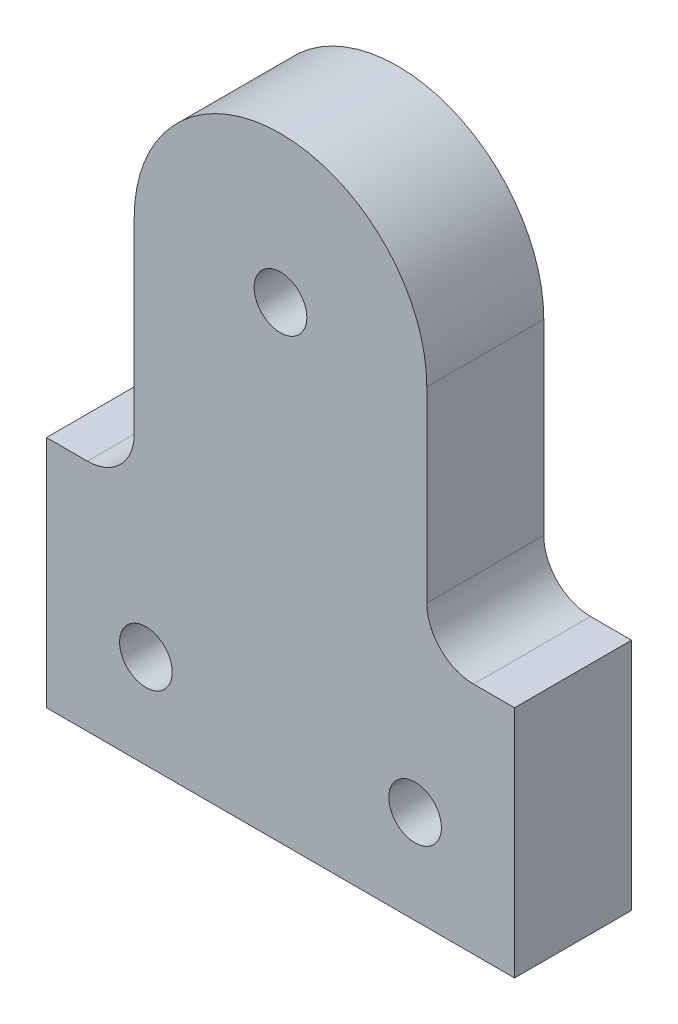
ISO-10303-21;
HEADER;
FILE_DESCRIPTION(('STEP AP214'),'2;1');
FILE_NAME('part.step','',(''),(''),'','','');
FILE_SCHEMA(('AUTOMOTIVE_DESIGN { 1 0 10303 214 1 1 1 1 }'));
ENDSEC;
DATA;
#1=APPLICATION_CONTEXT('core data for automotive mechanical design processes');
#2=APPLICATION_PROTOCOL_DEFINITION('international standard','automotive_design',2000,#1);
#3=PRODUCT_CONTEXT('',#1,'mechanical');
#4=PRODUCT('Part','Part','',(#3));
#5=PRODUCT_RELATED_PRODUCT_CATEGORY('part','',(#4));
#6=PRODUCT_DEFINITION_FORMATION('','',#4);
#7=PRODUCT_DEFINITION_CONTEXT('part definition',#1,'design');
#8=PRODUCT_DEFINITION('design','',#6,#7);
#9=PRODUCT_DEFINITION_SHAPE('','',#8);
#10=(LENGTH_UNIT() NAMED_UNIT(*) SI_UNIT(.MILLI.,.METRE.));
#11=(NAMED_UNIT(*) PLANE_ANGLE_UNIT() SI_UNIT($,.RADIAN.));
#12=(NAMED_UNIT(*) SI_UNIT($,.STERADIAN.) SOLID_ANGLE_UNIT());
#13=UNCERTAINTY_MEASURE_WITH_UNIT(LENGTH_MEASURE(1.E-05),#10,'distance_accuracy_value','');
#14=(GEOMETRIC_REPRESENTATION_CONTEXT(3) GLOBAL_UNCERTAINTY_ASSIGNED_CONTEXT((#13)) GLOBAL_UNIT_ASSIGNED_CONTEXT((#10,
#11,#12)) REPRESENTATION_CONTEXT('',''));
#15=CARTESIAN_POINT('',(0.,0.,0.));
#16=DIRECTION('',(0.,0.,1.));
#17=DIRECTION('',(1.,0.,0.));
#18=AXIS2_PLACEMENT_3D('',#15,#16,#17);
#19=CARTESIAN_POINT('',(-11.5,0.,10.));
#20=DIRECTION('',(0.,0.,-1.));
#21=DIRECTION('',(-1.,0.,0.));
#22=AXIS2_PLACEMENT_3D('',#19,#20,#21);
#23=CYLINDRICAL_SURFACE('',#22,2.25);
#24=CARTESIAN_POINT('',(-11.5,0.,10.));
#25=DIRECTION('',(0.,0.,1.));
#26=DIRECTION('',(1.,0.,0.));
#27=AXIS2_PLACEMENT_3D('',#24,#25,#26);
#28=CIRCLE('',#27,2.25);
#29=CARTESIAN_POINT('',(-9.25,0.,10.));
#30=VERTEX_POINT('',#29);
#31=EDGE_CURVE('E295',#30,#30,#28,.T.);
#32=ORIENTED_EDGE('',*,*,#31,.T.);
#33=EDGE_LOOP('',(#32));
#34=FACE_BOUND('',#33,.T.);
#35=CARTESIAN_POINT('',(-11.5,0.,3.));
#36=DIRECTION('',(0.,0.,-1.));
#37=DIRECTION('',(-1.,0.,0.));
#38=AXIS2_PLACEMENT_3D('',#35,#36,#37);
#39=CIRCLE('',#38,2.25);
#40=CARTESIAN_POINT('',(-13.75,0.,3.));
#41=VERTEX_POINT('',#40);
#42=EDGE_CURVE('E38',#41,#41,#39,.T.);
#43=ORIENTED_EDGE('',*,*,#42,.T.);
#44=EDGE_LOOP('',(#43));
#45=FACE_BOUND('',#44,.T.);
#46=ADVANCED_FACE('F34',(#34,#45),#23,.F.);
#47=CARTESIAN_POINT('',(11.5,0.,10.));
#48=DIRECTION('',(0.,0.,-1.));
#49=DIRECTION('',(-1.,0.,0.));
#50=AXIS2_PLACEMENT_3D('',#47,#48,#49);
#51=CYLINDRICAL_SURFACE('',#50,2.25);
#52=CARTESIAN_POINT('',(11.5,0.,10.));
#53=DIRECTION('',(0.,0.,1.));
#54=DIRECTION('',(-1.,0.,0.));
#55=AXIS2_PLACEMENT_3D('',#52,#53,#54);
#56=CIRCLE('',#55,2.25);
#57=CARTESIAN_POINT('',(9.25,0.,10.));
#58=VERTEX_POINT('',#57);
#59=EDGE_CURVE('E289',#58,#58,#56,.T.);
#60=ORIENTED_EDGE('',*,*,#59,.T.);
#61=EDGE_LOOP('',(#60));
#62=FACE_BOUND('',#61,.T.);
#63=CARTESIAN_POINT('',(11.5,0.,3.));
#64=DIRECTION('',(0.,0.,-1.));
#65=DIRECTION('',(-1.,0.,0.));
#66=AXIS2_PLACEMENT_3D('',#63,#64,#65);
#67=CIRCLE('',#66,2.25);
#68=CARTESIAN_POINT('',(9.25,0.,3.));
#69=VERTEX_POINT('',#68);
#70=EDGE_CURVE('E233',#69,#69,#67,.T.);
#71=ORIENTED_EDGE('',*,*,#70,.T.);
#72=EDGE_LOOP('',(#71));
#73=FACE_BOUND('',#72,.T.);
#74=ADVANCED_FACE('F427',(#62,#73),#51,.F.);
#75=CARTESIAN_POINT('',(0.,32.,10.));
#76=DIRECTION('',(0.,0.,1.));
#77=DIRECTION('',(1.,0.,0.));
#78=AXIS2_PLACEMENT_3D('',#75,#76,#77);
#79=PLANE('',#78);
#80=ORIENTED_EDGE('',*,*,#59,.F.);
#81=EDGE_LOOP('',(#80));
#82=FACE_BOUND('',#81,.T.);
#83=CARTESIAN_POINT('',(0.,32.,10.));
#84=DIRECTION('',(0.,0.,1.));
#85=DIRECTION('',(1.,0.,0.));
#86=AXIS2_PLACEMENT_3D('',#83,#84,#85);
#87=CIRCLE('',#86,12.5);
#88=CARTESIAN_POINT('',(12.5,32.,10.));
#89=VERTEX_POINT('',#88);
#90=CARTESIAN_POINT('',(-12.5,32.,10.));
#91=VERTEX_POINT('',#90);
#92=EDGE_CURVE('E299',#89,#91,#87,.T.);
#93=ORIENTED_EDGE('',*,*,#92,.T.);
#94=DIRECTION('',(0.,-1.,0.));
#95=VECTOR('',#94,1.);
#96=CARTESIAN_POINT('',(-12.5,32.,10.));
#97=LINE('',#96,#95);
#98=CARTESIAN_POINT('',(-12.5,16.,10.));
#99=VERTEX_POINT('',#98);
#100=EDGE_CURVE('E302',#91,#99,#97,.T.);
#101=ORIENTED_EDGE('',*,*,#100,.T.);
#102=CARTESIAN_POINT('',(-16.5,16.,10.));
#103=DIRECTION('',(0.,0.,-1.));
#104=DIRECTION('',(1.,0.,0.));
#105=AXIS2_PLACEMENT_3D('',#102,#103,#104);
#106=CIRCLE('',#105,4.);
#107=CARTESIAN_POINT('',(-16.5,12.,10.));
#108=VERTEX_POINT('',#107);
#109=EDGE_CURVE('E305',#99,#108,#106,.T.);
#110=ORIENTED_EDGE('',*,*,#109,.T.);
#111=DIRECTION('',(-1.,0.,0.));
#112=VECTOR('',#111,1.);
#113=CARTESIAN_POINT('',(-16.5,12.,10.));
#114=LINE('',#113,#112);
#115=CARTESIAN_POINT('',(-20.,12.,10.));
#116=VERTEX_POINT('',#115);
#117=EDGE_CURVE('E307',#108,#116,#114,.T.);
#118=ORIENTED_EDGE('',*,*,#117,.T.);
#119=DIRECTION('',(0.,-1.,0.));
#120=VECTOR('',#119,1.);
#121=CARTESIAN_POINT('',(-20.,12.,10.));
#122=LINE('',#121,#120);
#123=CARTESIAN_POINT('',(-20.,-8.,10.));
#124=VERTEX_POINT('',#123);
#125=EDGE_CURVE('E309',#116,#124,#122,.T.);
#126=ORIENTED_EDGE('',*,*,#125,.T.);
#127=DIRECTION('',(1.,0.,0.));
#128=VECTOR('',#127,1.);
#129=CARTESIAN_POINT('',(-20.,-8.,10.));
#130=LINE('',#129,#128);
#131=CARTESIAN_POINT('',(20.,-7.99999999999999,10.));
#132=VERTEX_POINT('',#131);
#133=EDGE_CURVE('E311',#124,#132,#130,.T.);
#134=ORIENTED_EDGE('',*,*,#133,.T.);
#135=DIRECTION('',(0.,1.,0.));
#136=VECTOR('',#135,1.);
#137=CARTESIAN_POINT('',(20.,12.,10.));
#138=LINE('',#137,#136);
#139=CARTESIAN_POINT('',(20.,12.,10.));
#140=VERTEX_POINT('',#139);
#141=EDGE_CURVE('E313',#132,#140,#138,.T.);
#142=ORIENTED_EDGE('',*,*,#141,.T.);
#143=DIRECTION('',(-1.,0.,0.));
#144=VECTOR('',#143,1.);
#145=CARTESIAN_POINT('',(16.5,12.,10.));
#146=LINE('',#145,#144);
#147=CARTESIAN_POINT('',(16.5,12.,10.));
#148=VERTEX_POINT('',#147);
#149=EDGE_CURVE('E315',#140,#148,#146,.T.);
#150=ORIENTED_EDGE('',*,*,#149,.T.);
#151=CARTESIAN_POINT('',(16.5,16.,10.));
#152=DIRECTION('',(0.,0.,-1.));
#153=DIRECTION('',(-1.,0.,0.));
#154=AXIS2_PLACEMENT_3D('',#151,#152,#153);
#155=CIRCLE('',#154,4.);
#156=CARTESIAN_POINT('',(12.5,16.,10.));
#157=VERTEX_POINT('',#156);
#158=EDGE_CURVE('E317',#148,#157,#155,.T.);
#159=ORIENTED_EDGE('',*,*,#158,.T.);
#160=DIRECTION('',(0.,1.,0.));
#161=VECTOR('',#160,1.);
#162=CARTESIAN_POINT('',(12.5,32.,10.));
#163=LINE('',#162,#161);
#164=EDGE_CURVE('E319',#157,#89,#163,.T.);
#165=ORIENTED_EDGE('',*,*,#164,.T.);
#166=EDGE_LOOP('',(#93,#101,#110,#118,#126,#134,#142,#150,#159,#165));
#167=FACE_BOUND('',#166,.T.);
#168=ORIENTED_EDGE('',*,*,#31,.F.);
#169=EDGE_LOOP('',(#168));
#170=FACE_BOUND('',#169,.T.);
#171=CARTESIAN_POINT('',(0.,32.,10.));
#172=DIRECTION('',(0.,0.,1.));
#173=DIRECTION('',(1.,0.,0.));
#174=AXIS2_PLACEMENT_3D('',#171,#172,#173);
#175=CIRCLE('',#174,2.25);
#176=CARTESIAN_POINT('',(2.25,32.,10.));
#177=VERTEX_POINT('',#176);
#178=EDGE_CURVE('E286',#177,#177,#175,.T.);
#179=ORIENTED_EDGE('',*,*,#178,.F.);
#180=EDGE_LOOP('',(#179));
#181=FACE_BOUND('',#180,.T.);
#182=ADVANCED_FACE('F402',(#82,#167,#170,#181),#79,.T.);
#183=CARTESIAN_POINT('',(0.,32.,0.));
#184=DIRECTION('',(0.,0.,1.));
#185=DIRECTION('',(1.,0.,0.));
#186=AXIS2_PLACEMENT_3D('',#183,#184,#185);
#187=PLANE('',#186);
#188=DIRECTION('',(-0.866025403784438,0.5,0.));
#189=VECTOR('',#188,1.);
#190=CARTESIAN_POINT('',(11.5,-4.33012701892219,0.));
#191=LINE('',#190,#189);
#192=CARTESIAN_POINT('',(11.5,-4.33012701892219,0.));
#193=VERTEX_POINT('',#192);
#194=CARTESIAN_POINT('',(7.75,-2.16506350946109,0.));
#195=VERTEX_POINT('',#194);
#196=EDGE_CURVE('E220',#193,#195,#191,.T.);
#197=ORIENTED_EDGE('',*,*,#196,.F.);
#198=DIRECTION('',(-0.866025403784438,-0.5,0.));
#199=VECTOR('',#198,1.);
#200=CARTESIAN_POINT('',(15.25,-2.16506350946109,0.));
#201=LINE('',#200,#199);
#202=CARTESIAN_POINT('',(15.25,-2.16506350946109,0.));
#203=VERTEX_POINT('',#202);
#204=EDGE_CURVE('E51',#203,#193,#201,.T.);
#205=ORIENTED_EDGE('',*,*,#204,.F.);
#206=DIRECTION('',(0.,-1.,0.));
#207=VECTOR('',#206,1.);
#208=CARTESIAN_POINT('',(15.25,2.1650635094611,0.));
#209=LINE('',#208,#207);
#210=CARTESIAN_POINT('',(15.25,2.1650635094611,0.));
#211=VERTEX_POINT('',#210);
#212=EDGE_CURVE('E206',#211,#203,#209,.T.);
#213=ORIENTED_EDGE('',*,*,#212,.F.);
#214=DIRECTION('',(0.866025403784438,-0.5,0.));
#215=VECTOR('',#214,1.);
#216=CARTESIAN_POINT('',(11.5,4.3301270189222,0.));
#217=LINE('',#216,#215);
#218=CARTESIAN_POINT('',(11.5,4.3301270189222,0.));
#219=VERTEX_POINT('',#218);
#220=EDGE_CURVE('E209',#219,#211,#217,.T.);
#221=ORIENTED_EDGE('',*,*,#220,.F.);
#222=DIRECTION('',(0.866025403784439,0.5,0.));
#223=VECTOR('',#222,1.);
#224=CARTESIAN_POINT('',(7.75,2.16506350946111,0.));
#225=LINE('',#224,#223);
#226=CARTESIAN_POINT('',(7.75,2.16506350946111,0.));
#227=VERTEX_POINT('',#226);
#228=EDGE_CURVE('E226',#227,#219,#225,.T.);
#229=ORIENTED_EDGE('',*,*,#228,.F.);
#230=DIRECTION('',(0.,1.,0.));
#231=VECTOR('',#230,1.);
#232=CARTESIAN_POINT('',(7.75,-2.16506350946109,0.));
#233=LINE('',#232,#231);
#234=EDGE_CURVE('E223',#195,#227,#233,.T.);
#235=ORIENTED_EDGE('',*,*,#234,.F.);
#236=EDGE_LOOP('',(#197,#205,#213,#221,#229,#235));
#237=FACE_BOUND('',#236,.T.);
#238=DIRECTION('',(-0.866025403784438,0.500000000000001,0.));
#239=VECTOR('',#238,1.);
#240=CARTESIAN_POINT('',(-11.5,-4.33012701892219,0.));
#241=LINE('',#240,#239);
#242=CARTESIAN_POINT('',(-11.5,-4.3301270189222,0.));
#243=VERTEX_POINT('',#242);
#244=CARTESIAN_POINT('',(-15.25,-2.16506350946109,0.));
#245=VERTEX_POINT('',#244);
#246=EDGE_CURVE('E262',#243,#245,#241,.T.);
#247=ORIENTED_EDGE('',*,*,#246,.F.);
#248=DIRECTION('',(-0.866025403784442,-0.499999999999995,0.));
#249=VECTOR('',#248,1.);
#250=CARTESIAN_POINT('',(-7.75000000000002,-2.16506350946114,0.));
#251=LINE('',#250,#249);
#252=CARTESIAN_POINT('',(-7.75000000000002,-2.16506350946114,0.));
#253=VERTEX_POINT('',#252);
#254=EDGE_CURVE('E59',#253,#243,#251,.T.);
#255=ORIENTED_EDGE('',*,*,#254,.F.);
#256=DIRECTION('',(0.,-1.,0.));
#257=VECTOR('',#256,1.);
#258=CARTESIAN_POINT('',(-7.74999999999998,2.16506350946106,0.));
#259=LINE('',#258,#257);
#260=CARTESIAN_POINT('',(-7.74999999999998,2.16506350946106,0.));
#261=VERTEX_POINT('',#260);
#262=EDGE_CURVE('E245',#261,#253,#259,.T.);
#263=ORIENTED_EDGE('',*,*,#262,.F.);
#264=DIRECTION('',(0.866025403784435,-0.500000000000007,0.));
#265=VECTOR('',#264,1.);
#266=CARTESIAN_POINT('',(-11.5,4.33012701892219,0.));
#267=LINE('',#266,#265);
#268=CARTESIAN_POINT('',(-11.5,4.33012701892219,0.));
#269=VERTEX_POINT('',#268);
#270=EDGE_CURVE('E271',#269,#261,#267,.T.);
#271=ORIENTED_EDGE('',*,*,#270,.F.);
#272=DIRECTION('',(0.866025403784441,0.499999999999995,0.));
#273=VECTOR('',#272,1.);
#274=CARTESIAN_POINT('',(-15.25,2.16506350946111,0.));
#275=LINE('',#274,#273);
#276=CARTESIAN_POINT('',(-15.25,2.16506350946111,0.));
#277=VERTEX_POINT('',#276);
#278=EDGE_CURVE('E268',#277,#269,#275,.T.);
#279=ORIENTED_EDGE('',*,*,#278,.F.);
#280=DIRECTION('',(0.,1.,0.));
#281=VECTOR('',#280,1.);
#282=CARTESIAN_POINT('',(-15.25,-2.16506350946109,0.));
#283=LINE('',#282,#281);
#284=EDGE_CURVE('E265',#245,#277,#283,.T.);
#285=ORIENTED_EDGE('',*,*,#284,.F.);
#286=EDGE_LOOP('',(#247,#255,#263,#271,#279,#285));
#287=FACE_BOUND('',#286,.T.);
#288=CARTESIAN_POINT('',(0.,32.,0.));
#289=DIRECTION('',(0.,0.,1.));
#290=DIRECTION('',(1.,0.,0.));
#291=AXIS2_PLACEMENT_3D('',#288,#289,#290);
#292=CIRCLE('',#291,12.5);
#293=CARTESIAN_POINT('',(12.5,32.,0.));
#294=VERTEX_POINT('',#293);
#295=CARTESIAN_POINT('',(-12.5,32.,0.));
#296=VERTEX_POINT('',#295);
#297=EDGE_CURVE('E298',#294,#296,#292,.T.);
#298=ORIENTED_EDGE('',*,*,#297,.F.);
#299=DIRECTION('',(0.,1.,0.));
#300=VECTOR('',#299,1.);
#301=CARTESIAN_POINT('',(12.5,32.,0.));
#302=LINE('',#301,#300);
#303=CARTESIAN_POINT('',(12.5,16.,0.));
#304=VERTEX_POINT('',#303);
#305=EDGE_CURVE('E303',#304,#294,#302,.T.);
#306=ORIENTED_EDGE('',*,*,#305,.F.);
#307=CARTESIAN_POINT('',(16.5,16.,0.));
#308=DIRECTION('',(0.,0.,-1.));
#309=DIRECTION('',(-1.,0.,0.));
#310=AXIS2_PLACEMENT_3D('',#307,#308,#309);
#311=CIRCLE('',#310,4.);
#312=CARTESIAN_POINT('',(16.5,12.,0.));
#313=VERTEX_POINT('',#312);
#314=EDGE_CURVE('E338',#313,#304,#311,.T.);
#315=ORIENTED_EDGE('',*,*,#314,.F.);
#316=DIRECTION('',(-1.,0.,0.));
#317=VECTOR('',#316,1.);
#318=CARTESIAN_POINT('',(16.5,12.,0.));
#319=LINE('',#318,#317);
#320=CARTESIAN_POINT('',(20.,12.,0.));
#321=VERTEX_POINT('',#320);
#322=EDGE_CURVE('E336',#321,#313,#319,.T.);
#323=ORIENTED_EDGE('',*,*,#322,.F.);
#324=DIRECTION('',(0.,1.,0.));
#325=VECTOR('',#324,1.);
#326=CARTESIAN_POINT('',(20.,12.,0.));
#327=LINE('',#326,#325);
#328=CARTESIAN_POINT('',(20.,-7.99999999999999,0.));
#329=VERTEX_POINT('',#328);
#330=EDGE_CURVE('E334',#329,#321,#327,.T.);
#331=ORIENTED_EDGE('',*,*,#330,.F.);
#332=DIRECTION('',(1.,0.,0.));
#333=VECTOR('',#332,1.);
#334=CARTESIAN_POINT('',(-20.,-8.,0.));
#335=LINE('',#334,#333);
#336=CARTESIAN_POINT('',(-20.,-8.,0.));
#337=VERTEX_POINT('',#336);
#338=EDGE_CURVE('E332',#337,#329,#335,.T.);
#339=ORIENTED_EDGE('',*,*,#338,.F.);
#340=DIRECTION('',(0.,-1.,0.));
#341=VECTOR('',#340,1.);
#342=CARTESIAN_POINT('',(-20.,12.,0.));
#343=LINE('',#342,#341);
#344=CARTESIAN_POINT('',(-20.,12.,0.));
#345=VERTEX_POINT('',#344);
#346=EDGE_CURVE('E330',#345,#337,#343,.T.);
#347=ORIENTED_EDGE('',*,*,#346,.F.);
#348=DIRECTION('',(-1.,0.,0.));
#349=VECTOR('',#348,1.);
#350=CARTESIAN_POINT('',(-16.5,12.,0.));
#351=LINE('',#350,#349);
#352=CARTESIAN_POINT('',(-16.5,12.,0.));
#353=VERTEX_POINT('',#352);
#354=EDGE_CURVE('E328',#353,#345,#351,.T.);
#355=ORIENTED_EDGE('',*,*,#354,.F.);
#356=CARTESIAN_POINT('',(-16.5,16.,0.));
#357=DIRECTION('',(0.,0.,-1.));
#358=DIRECTION('',(1.,0.,0.));
#359=AXIS2_PLACEMENT_3D('',#356,#357,#358);
#360=CIRCLE('',#359,4.);
#361=CARTESIAN_POINT('',(-12.5,16.,0.));
#362=VERTEX_POINT('',#361);
#363=EDGE_CURVE('E326',#362,#353,#360,.T.);
#364=ORIENTED_EDGE('',*,*,#363,.F.);
#365=DIRECTION('',(0.,-1.,0.));
#366=VECTOR('',#365,1.);
#367=CARTESIAN_POINT('',(-12.5,32.,0.));
#368=LINE('',#367,#366);
#369=EDGE_CURVE('E324',#296,#362,#368,.T.);
#370=ORIENTED_EDGE('',*,*,#369,.F.);
#371=EDGE_LOOP('',(#298,#306,#315,#323,#331,#339,#347,#355,#364,#370));
#372=FACE_BOUND('',#371,.T.);
#373=CARTESIAN_POINT('',(0.,32.,0.));
#374=DIRECTION('',(0.,0.,1.));
#375=DIRECTION('',(1.,0.,0.));
#376=AXIS2_PLACEMENT_3D('',#373,#374,#375);
#377=CIRCLE('',#376,2.25);
#378=CARTESIAN_POINT('',(2.25,32.,0.));
#379=VERTEX_POINT('',#378);
#380=EDGE_CURVE('E290',#379,#379,#377,.T.);
#381=ORIENTED_EDGE('',*,*,#380,.T.);
#382=EDGE_LOOP('',(#381));
#383=FACE_BOUND('',#382,.T.);
#384=ADVANCED_FACE('F399',(#237,#287,#372,#383),#187,.F.);
#385=CARTESIAN_POINT('',(0.,32.,10.));
#386=DIRECTION('',(0.,0.,-1.));
#387=DIRECTION('',(-1.,0.,0.));
#388=AXIS2_PLACEMENT_3D('',#385,#386,#387);
#389=CYLINDRICAL_SURFACE('',#388,12.5);
#390=ORIENTED_EDGE('',*,*,#297,.T.);
#391=DIRECTION('',(0.,0.,-1.));
#392=VECTOR('',#391,1.);
#393=CARTESIAN_POINT('',(-12.5,32.,10.));
#394=LINE('',#393,#392);
#395=EDGE_CURVE('E11',#91,#296,#394,.T.);
#396=ORIENTED_EDGE('',*,*,#395,.F.);
#397=ORIENTED_EDGE('',*,*,#92,.F.);
#398=DIRECTION('',(0.,0.,-1.));
#399=VECTOR('',#398,1.);
#400=CARTESIAN_POINT('',(12.5,32.,10.));
#401=LINE('',#400,#399);
#402=EDGE_CURVE('E321',#89,#294,#401,.T.);
#403=ORIENTED_EDGE('',*,*,#402,.T.);
#404=EDGE_LOOP('',(#390,#396,#397,#403));
#405=FACE_BOUND('',#404,.T.);
#406=ADVANCED_FACE('F36',(#405),#389,.T.);
#407=CARTESIAN_POINT('',(-12.5,32.,10.));
#408=DIRECTION('',(1.,0.,0.));
#409=DIRECTION('',(0.,1.,0.));
#410=AXIS2_PLACEMENT_3D('',#407,#408,#409);
#411=PLANE('',#410);
#412=ORIENTED_EDGE('',*,*,#369,.T.);
#413=DIRECTION('',(0.,0.,-1.));
#414=VECTOR('',#413,1.);
#415=CARTESIAN_POINT('',(-12.5,16.,10.));
#416=LINE('',#415,#414);
#417=EDGE_CURVE('E43',#99,#362,#416,.T.);
#418=ORIENTED_EDGE('',*,*,#417,.F.);
#419=ORIENTED_EDGE('',*,*,#100,.F.);
#420=ORIENTED_EDGE('',*,*,#395,.T.);
#421=EDGE_LOOP('',(#412,#418,#419,#420));
#422=FACE_BOUND('',#421,.T.);
#423=ADVANCED_FACE('F463',(#422),#411,.F.);
#424=CARTESIAN_POINT('',(-16.5,16.,10.));
#425=DIRECTION('',(0.,0.,-1.));
#426=DIRECTION('',(-1.,0.,0.));
#427=AXIS2_PLACEMENT_3D('',#424,#425,#426);
#428=CYLINDRICAL_SURFACE('',#427,4.);
#429=ORIENTED_EDGE('',*,*,#363,.T.);
#430=DIRECTION('',(0.,0.,-1.));
#431=VECTOR('',#430,1.);
#432=CARTESIAN_POINT('',(-16.5,12.,10.));
#433=LINE('',#432,#431);
#434=EDGE_CURVE('E361',#108,#353,#433,.T.);
#435=ORIENTED_EDGE('',*,*,#434,.F.);
#436=ORIENTED_EDGE('',*,*,#109,.F.);
#437=ORIENTED_EDGE('',*,*,#417,.T.);
#438=EDGE_LOOP('',(#429,#435,#436,#437));
#439=FACE_BOUND('',#438,.T.);
#440=ADVANCED_FACE('F460',(#439),#428,.F.);
#441=CARTESIAN_POINT('',(-16.5,12.,10.));
#442=DIRECTION('',(0.,-1.,0.));
#443=DIRECTION('',(0.,0.,-1.));
#444=AXIS2_PLACEMENT_3D('',#441,#442,#443);
#445=PLANE('',#444);
#446=ORIENTED_EDGE('',*,*,#354,.T.);
#447=DIRECTION('',(0.,0.,-1.));
#448=VECTOR('',#447,1.);
#449=CARTESIAN_POINT('',(-20.,12.,10.));
#450=LINE('',#449,#448);
#451=EDGE_CURVE('E358',#116,#345,#450,.T.);
#452=ORIENTED_EDGE('',*,*,#451,.F.);
#453=ORIENTED_EDGE('',*,*,#117,.F.);
#454=ORIENTED_EDGE('',*,*,#434,.T.);
#455=EDGE_LOOP('',(#446,#452,#453,#454));
#456=FACE_BOUND('',#455,.T.);
#457=ADVANCED_FACE('F456',(#456),#445,.F.);
#458=CARTESIAN_POINT('',(-20.,12.,10.));
#459=DIRECTION('',(1.,0.,0.));
#460=DIRECTION('',(0.,0.,-1.));
#461=AXIS2_PLACEMENT_3D('',#458,#459,#460);
#462=PLANE('',#461);
#463=ORIENTED_EDGE('',*,*,#346,.T.);
#464=DIRECTION('',(0.,0.,-1.));
#465=VECTOR('',#464,1.);
#466=CARTESIAN_POINT('',(-20.,-8.,10.));
#467=LINE('',#466,#465);
#468=EDGE_CURVE('E355',#124,#337,#467,.T.);
#469=ORIENTED_EDGE('',*,*,#468,.F.);
#470=ORIENTED_EDGE('',*,*,#125,.F.);
#471=ORIENTED_EDGE('',*,*,#451,.T.);
#472=EDGE_LOOP('',(#463,#469,#470,#471));
#473=FACE_BOUND('',#472,.T.);
#474=ADVANCED_FACE('F452',(#473),#462,.F.);
#475=CARTESIAN_POINT('',(-20.,-8.,10.));
#476=DIRECTION('',(0.,1.,0.));
#477=DIRECTION('',(-1.,0.,0.));
#478=AXIS2_PLACEMENT_3D('',#475,#476,#477);
#479=PLANE('',#478);
#480=ORIENTED_EDGE('',*,*,#338,.T.);
#481=DIRECTION('',(0.,0.,-1.));
#482=VECTOR('',#481,1.);
#483=CARTESIAN_POINT('',(20.,-7.99999999999999,10.));
#484=LINE('',#483,#482);
#485=EDGE_CURVE('E352',#132,#329,#484,.T.);
#486=ORIENTED_EDGE('',*,*,#485,.F.);
#487=ORIENTED_EDGE('',*,*,#133,.F.);
#488=ORIENTED_EDGE('',*,*,#468,.T.);
#489=EDGE_LOOP('',(#480,#486,#487,#488));
#490=FACE_BOUND('',#489,.T.);
#491=ADVANCED_FACE('F448',(#490),#479,.F.);
#492=CARTESIAN_POINT('',(20.,12.,10.));
#493=DIRECTION('',(-1.,0.,0.));
#494=DIRECTION('',(0.,0.,1.));
#495=AXIS2_PLACEMENT_3D('',#492,#493,#494);
#496=PLANE('',#495);
#497=ORIENTED_EDGE('',*,*,#330,.T.);
#498=DIRECTION('',(0.,0.,-1.));
#499=VECTOR('',#498,1.);
#500=CARTESIAN_POINT('',(20.,12.,10.));
#501=LINE('',#500,#499);
#502=EDGE_CURVE('E349',#140,#321,#501,.T.);
#503=ORIENTED_EDGE('',*,*,#502,.F.);
#504=ORIENTED_EDGE('',*,*,#141,.F.);
#505=ORIENTED_EDGE('',*,*,#485,.T.);
#506=EDGE_LOOP('',(#497,#503,#504,#505));
#507=FACE_BOUND('',#506,.T.);
#508=ADVANCED_FACE('F444',(#507),#496,.F.);
#509=CARTESIAN_POINT('',(16.5,12.,10.));
#510=DIRECTION('',(0.,-1.,0.));
#511=DIRECTION('',(0.,0.,-1.));
#512=AXIS2_PLACEMENT_3D('',#509,#510,#511);
#513=PLANE('',#512);
#514=ORIENTED_EDGE('',*,*,#322,.T.);
#515=DIRECTION('',(0.,0.,-1.));
#516=VECTOR('',#515,1.);
#517=CARTESIAN_POINT('',(16.5,12.,10.));
#518=LINE('',#517,#516);
#519=EDGE_CURVE('E346',#148,#313,#518,.T.);
#520=ORIENTED_EDGE('',*,*,#519,.F.);
#521=ORIENTED_EDGE('',*,*,#149,.F.);
#522=ORIENTED_EDGE('',*,*,#502,.T.);
#523=EDGE_LOOP('',(#514,#520,#521,#522));
#524=FACE_BOUND('',#523,.T.);
#525=ADVANCED_FACE('F440',(#524),#513,.F.);
#526=CARTESIAN_POINT('',(16.5,16.,10.));
#527=DIRECTION('',(0.,0.,-1.));
#528=DIRECTION('',(-1.,0.,0.));
#529=AXIS2_PLACEMENT_3D('',#526,#527,#528);
#530=CYLINDRICAL_SURFACE('',#529,4.);
#531=ORIENTED_EDGE('',*,*,#314,.T.);
#532=DIRECTION('',(0.,0.,-1.));
#533=VECTOR('',#532,1.);
#534=CARTESIAN_POINT('',(12.5,16.,10.));
#535=LINE('',#534,#533);
#536=EDGE_CURVE('E343',#157,#304,#535,.T.);
#537=ORIENTED_EDGE('',*,*,#536,.F.);
#538=ORIENTED_EDGE('',*,*,#158,.F.);
#539=ORIENTED_EDGE('',*,*,#519,.T.);
#540=EDGE_LOOP('',(#531,#537,#538,#539));
#541=FACE_BOUND('',#540,.T.);
#542=ADVANCED_FACE('F421',(#541),#530,.F.);
#543=CARTESIAN_POINT('',(12.5,32.,10.));
#544=DIRECTION('',(-1.,0.,0.));
#545=DIRECTION('',(0.,-1.,0.));
#546=AXIS2_PLACEMENT_3D('',#543,#544,#545);
#547=PLANE('',#546);
#548=ORIENTED_EDGE('',*,*,#305,.T.);
#549=ORIENTED_EDGE('',*,*,#402,.F.);
#550=ORIENTED_EDGE('',*,*,#164,.F.);
#551=ORIENTED_EDGE('',*,*,#536,.T.);
#552=EDGE_LOOP('',(#548,#549,#550,#551));
#553=FACE_BOUND('',#552,.T.);
#554=ADVANCED_FACE('F412',(#553),#547,.F.);
#555=CARTESIAN_POINT('',(0.,32.,10.));
#556=DIRECTION('',(0.,0.,-1.));
#557=DIRECTION('',(-1.,0.,0.));
#558=AXIS2_PLACEMENT_3D('',#555,#556,#557);
#559=CYLINDRICAL_SURFACE('',#558,2.25);
#560=ORIENTED_EDGE('',*,*,#178,.T.);
#561=EDGE_LOOP('',(#560));
#562=FACE_BOUND('',#561,.T.);
#563=ORIENTED_EDGE('',*,*,#380,.F.);
#564=EDGE_LOOP('',(#563));
#565=FACE_BOUND('',#564,.T.);
#566=ADVANCED_FACE('F410',(#562,#565),#559,.F.);
#567=CARTESIAN_POINT('',(15.25,-2.16506350946109,3.));
#568=DIRECTION('',(0.5,-0.866025403784439,0.));
#569=DIRECTION('',(0.866025403784439,0.5,0.));
#570=AXIS2_PLACEMENT_3D('',#567,#568,#569);
#571=PLANE('',#570);
#572=ORIENTED_EDGE('',*,*,#204,.T.);
#573=DIRECTION('',(0.,0.,-1.));
#574=VECTOR('',#573,1.);
#575=CARTESIAN_POINT('',(11.5,-4.33012701892219,3.));
#576=LINE('',#575,#574);
#577=CARTESIAN_POINT('',(11.5,-4.33012701892219,3.));
#578=VERTEX_POINT('',#577);
#579=EDGE_CURVE('E183',#578,#193,#576,.T.);
#580=ORIENTED_EDGE('',*,*,#579,.F.);
#581=DIRECTION('',(-0.866025403784438,-0.5,0.));
#582=VECTOR('',#581,1.);
#583=CARTESIAN_POINT('',(15.25,-2.16506350946109,3.));
#584=LINE('',#583,#582);
#585=CARTESIAN_POINT('',(15.25,-2.16506350946109,3.));
#586=VERTEX_POINT('',#585);
#587=EDGE_CURVE('E187',#586,#578,#584,.T.);
#588=ORIENTED_EDGE('',*,*,#587,.F.);
#589=DIRECTION('',(0.,0.,-1.));
#590=VECTOR('',#589,1.);
#591=CARTESIAN_POINT('',(15.25,-2.16506350946109,3.));
#592=LINE('',#591,#590);
#593=EDGE_CURVE('E231',#586,#203,#592,.T.);
#594=ORIENTED_EDGE('',*,*,#593,.T.);
#595=EDGE_LOOP('',(#572,#580,#588,#594));
#596=FACE_BOUND('',#595,.T.);
#597=ADVANCED_FACE('F185',(#596),#571,.F.);
#598=CARTESIAN_POINT('',(15.25,2.1650635094611,3.));
#599=DIRECTION('',(1.,0.,0.));
#600=DIRECTION('',(0.,0.,-1.));
#601=AXIS2_PLACEMENT_3D('',#598,#599,#600);
#602=PLANE('',#601);
#603=ORIENTED_EDGE('',*,*,#212,.T.);
#604=ORIENTED_EDGE('',*,*,#593,.F.);
#605=DIRECTION('',(0.,-1.,0.));
#606=VECTOR('',#605,1.);
#607=CARTESIAN_POINT('',(15.25,2.1650635094611,3.));
#608=LINE('',#607,#606);
#609=CARTESIAN_POINT('',(15.25,2.1650635094611,3.));
#610=VERTEX_POINT('',#609);
#611=EDGE_CURVE('E193',#610,#586,#608,.T.);
#612=ORIENTED_EDGE('',*,*,#611,.F.);
#613=DIRECTION('',(0.,0.,-1.));
#614=VECTOR('',#613,1.);
#615=CARTESIAN_POINT('',(15.25,2.1650635094611,3.));
#616=LINE('',#615,#614);
#617=EDGE_CURVE('E234',#610,#211,#616,.T.);
#618=ORIENTED_EDGE('',*,*,#617,.T.);
#619=EDGE_LOOP('',(#603,#604,#612,#618));
#620=FACE_BOUND('',#619,.T.);
#621=ADVANCED_FACE('F419',(#620),#602,.F.);
#622=CARTESIAN_POINT('',(11.5,4.3301270189222,3.));
#623=DIRECTION('',(0.5,0.866025403784439,0.));
#624=DIRECTION('',(-0.866025403784439,0.5,0.));
#625=AXIS2_PLACEMENT_3D('',#622,#623,#624);
#626=PLANE('',#625);
#627=ORIENTED_EDGE('',*,*,#220,.T.);
#628=ORIENTED_EDGE('',*,*,#617,.F.);
#629=DIRECTION('',(0.866025403784438,-0.5,0.));
#630=VECTOR('',#629,1.);
#631=CARTESIAN_POINT('',(11.5,4.3301270189222,3.));
#632=LINE('',#631,#630);
#633=CARTESIAN_POINT('',(11.5,4.3301270189222,3.));
#634=VERTEX_POINT('',#633);
#635=EDGE_CURVE('E216',#634,#610,#632,.T.);
#636=ORIENTED_EDGE('',*,*,#635,.F.);
#637=DIRECTION('',(0.,0.,-1.));
#638=VECTOR('',#637,1.);
#639=CARTESIAN_POINT('',(11.5,4.3301270189222,3.));
#640=LINE('',#639,#638);
#641=EDGE_CURVE('E236',#634,#219,#640,.T.);
#642=ORIENTED_EDGE('',*,*,#641,.T.);
#643=EDGE_LOOP('',(#627,#628,#636,#642));
#644=FACE_BOUND('',#643,.T.);
#645=ADVANCED_FACE('F597',(#644),#626,.F.);
#646=CARTESIAN_POINT('',(7.75,2.16506350946111,3.));
#647=DIRECTION('',(-0.5,0.866025403784439,0.));
#648=DIRECTION('',(-0.866025403784439,-0.5,0.));
#649=AXIS2_PLACEMENT_3D('',#646,#647,#648);
#650=PLANE('',#649);
#651=ORIENTED_EDGE('',*,*,#228,.T.);
#652=ORIENTED_EDGE('',*,*,#641,.F.);
#653=DIRECTION('',(0.866025403784439,0.5,0.));
#654=VECTOR('',#653,1.);
#655=CARTESIAN_POINT('',(7.75,2.16506350946111,3.));
#656=LINE('',#655,#654);
#657=CARTESIAN_POINT('',(7.75,2.16506350946111,3.));
#658=VERTEX_POINT('',#657);
#659=EDGE_CURVE('E213',#658,#634,#656,.T.);
#660=ORIENTED_EDGE('',*,*,#659,.F.);
#661=DIRECTION('',(0.,0.,-1.));
#662=VECTOR('',#661,1.);
#663=CARTESIAN_POINT('',(7.75,2.16506350946111,3.));
#664=LINE('',#663,#662);
#665=EDGE_CURVE('E238',#658,#227,#664,.T.);
#666=ORIENTED_EDGE('',*,*,#665,.T.);
#667=EDGE_LOOP('',(#651,#652,#660,#666));
#668=FACE_BOUND('',#667,.T.);
#669=ADVANCED_FACE('F606',(#668),#650,.F.);
#670=CARTESIAN_POINT('',(7.75,-2.16506350946109,3.));
#671=DIRECTION('',(-1.,0.,0.));
#672=DIRECTION('',(0.,-1.,0.));
#673=AXIS2_PLACEMENT_3D('',#670,#671,#672);
#674=PLANE('',#673);
#675=ORIENTED_EDGE('',*,*,#234,.T.);
#676=ORIENTED_EDGE('',*,*,#665,.F.);
#677=DIRECTION('',(0.,1.,0.));
#678=VECTOR('',#677,1.);
#679=CARTESIAN_POINT('',(7.75,-2.16506350946109,3.));
#680=LINE('',#679,#678);
#681=CARTESIAN_POINT('',(7.75,-2.16506350946109,3.));
#682=VERTEX_POINT('',#681);
#683=EDGE_CURVE('E201',#682,#658,#680,.T.);
#684=ORIENTED_EDGE('',*,*,#683,.F.);
#685=DIRECTION('',(0.,0.,-1.));
#686=VECTOR('',#685,1.);
#687=CARTESIAN_POINT('',(7.75,-2.16506350946109,3.));
#688=LINE('',#687,#686);
#689=EDGE_CURVE('E192',#682,#195,#688,.T.);
#690=ORIENTED_EDGE('',*,*,#689,.T.);
#691=EDGE_LOOP('',(#675,#676,#684,#690));
#692=FACE_BOUND('',#691,.T.);
#693=ADVANCED_FACE('F615',(#692),#674,.F.);
#694=CARTESIAN_POINT('',(11.5,-4.33012701892219,3.));
#695=DIRECTION('',(-0.5,-0.866025403784439,0.));
#696=DIRECTION('',(0.866025403784439,-0.5,0.));
#697=AXIS2_PLACEMENT_3D('',#694,#695,#696);
#698=PLANE('',#697);
#699=ORIENTED_EDGE('',*,*,#196,.T.);
#700=ORIENTED_EDGE('',*,*,#689,.F.);
#701=DIRECTION('',(-0.866025403784438,0.5,0.));
#702=VECTOR('',#701,1.);
#703=CARTESIAN_POINT('',(11.5,-4.33012701892219,3.));
#704=LINE('',#703,#702);
#705=EDGE_CURVE('E196',#578,#682,#704,.T.);
#706=ORIENTED_EDGE('',*,*,#705,.F.);
#707=ORIENTED_EDGE('',*,*,#579,.T.);
#708=EDGE_LOOP('',(#699,#700,#706,#707));
#709=FACE_BOUND('',#708,.T.);
#710=ADVANCED_FACE('F197',(#709),#698,.F.);
#711=CARTESIAN_POINT('',(0.,0.,3.));
#712=DIRECTION('',(0.,0.,-1.));
#713=DIRECTION('',(-1.,0.,0.));
#714=AXIS2_PLACEMENT_3D('',#711,#712,#713);
#715=PLANE('',#714);
#716=ORIENTED_EDGE('',*,*,#70,.F.);
#717=EDGE_LOOP('',(#716));
#718=FACE_BOUND('',#717,.T.);
#719=ORIENTED_EDGE('',*,*,#587,.T.);
#720=ORIENTED_EDGE('',*,*,#705,.T.);
#721=ORIENTED_EDGE('',*,*,#683,.T.);
#722=ORIENTED_EDGE('',*,*,#659,.T.);
#723=ORIENTED_EDGE('',*,*,#635,.T.);
#724=ORIENTED_EDGE('',*,*,#611,.T.);
#725=EDGE_LOOP('',(#719,#720,#721,#722,#723,#724));
#726=FACE_BOUND('',#725,.T.);
#727=ADVANCED_FACE('F203',(#718,#726),#715,.T.);
#728=CARTESIAN_POINT('',(-7.75000000000002,-2.16506350946114,3.));
#729=DIRECTION('',(0.499999999999995,-0.866025403784441,0.));
#730=DIRECTION('',(0.866025403784442,0.499999999999995,0.));
#731=AXIS2_PLACEMENT_3D('',#728,#729,#730);
#732=PLANE('',#731);
#733=ORIENTED_EDGE('',*,*,#254,.T.);
#734=DIRECTION('',(0.,0.,-1.));
#735=VECTOR('',#734,1.);
#736=CARTESIAN_POINT('',(-11.5,-4.33012701892219,3.));
#737=LINE('',#736,#735);
#738=CARTESIAN_POINT('',(-11.5,-4.33012701892219,3.));
#739=VERTEX_POINT('',#738);
#740=EDGE_CURVE('E260',#739,#243,#737,.T.);
#741=ORIENTED_EDGE('',*,*,#740,.F.);
#742=DIRECTION('',(-0.866025403784442,-0.499999999999995,0.));
#743=VECTOR('',#742,1.);
#744=CARTESIAN_POINT('',(-7.75000000000002,-2.16506350946114,3.));
#745=LINE('',#744,#743);
#746=CARTESIAN_POINT('',(-7.75000000000002,-2.16506350946114,3.));
#747=VERTEX_POINT('',#746);
#748=EDGE_CURVE('E241',#747,#739,#745,.T.);
#749=ORIENTED_EDGE('',*,*,#748,.F.);
#750=DIRECTION('',(0.,0.,-1.));
#751=VECTOR('',#750,1.);
#752=CARTESIAN_POINT('',(-7.75000000000002,-2.16506350946114,3.));
#753=LINE('',#752,#751);
#754=EDGE_CURVE('E221',#747,#253,#753,.T.);
#755=ORIENTED_EDGE('',*,*,#754,.T.);
#756=EDGE_LOOP('',(#733,#741,#749,#755));
#757=FACE_BOUND('',#756,.T.);
#758=ADVANCED_FACE('F380',(#757),#732,.F.);
#759=CARTESIAN_POINT('',(-7.74999999999998,2.16506350946106,3.));
#760=DIRECTION('',(1.,0.,0.));
#761=DIRECTION('',(0.,1.,0.));
#762=AXIS2_PLACEMENT_3D('',#759,#760,#761);
#763=PLANE('',#762);
#764=ORIENTED_EDGE('',*,*,#262,.T.);
#765=ORIENTED_EDGE('',*,*,#754,.F.);
#766=DIRECTION('',(0.,-1.,0.));
#767=VECTOR('',#766,1.);
#768=CARTESIAN_POINT('',(-7.74999999999998,2.16506350946106,3.));
#769=LINE('',#768,#767);
#770=CARTESIAN_POINT('',(-7.74999999999998,2.16506350946106,3.));
#771=VERTEX_POINT('',#770);
#772=EDGE_CURVE('E257',#771,#747,#769,.T.);
#773=ORIENTED_EDGE('',*,*,#772,.F.);
#774=DIRECTION('',(0.,0.,-1.));
#775=VECTOR('',#774,1.);
#776=CARTESIAN_POINT('',(-7.74999999999998,2.16506350946106,3.));
#777=LINE('',#776,#775);
#778=EDGE_CURVE('E277',#771,#261,#777,.T.);
#779=ORIENTED_EDGE('',*,*,#778,.T.);
#780=EDGE_LOOP('',(#764,#765,#773,#779));
#781=FACE_BOUND('',#780,.T.);
#782=ADVANCED_FACE('F397',(#781),#763,.F.);
#783=CARTESIAN_POINT('',(-11.5,4.33012701892219,3.));
#784=DIRECTION('',(0.500000000000007,0.866025403784434,0.));
#785=DIRECTION('',(-0.866025403784435,0.500000000000007,0.));
#786=AXIS2_PLACEMENT_3D('',#783,#784,#785);
#787=PLANE('',#786);
#788=ORIENTED_EDGE('',*,*,#270,.T.);
#789=ORIENTED_EDGE('',*,*,#778,.F.);
#790=DIRECTION('',(0.866025403784435,-0.500000000000007,0.));
#791=VECTOR('',#790,1.);
#792=CARTESIAN_POINT('',(-11.5,4.33012701892219,3.));
#793=LINE('',#792,#791);
#794=CARTESIAN_POINT('',(-11.5,4.33012701892219,3.));
#795=VERTEX_POINT('',#794);
#796=EDGE_CURVE('E254',#795,#771,#793,.T.);
#797=ORIENTED_EDGE('',*,*,#796,.F.);
#798=DIRECTION('',(0.,0.,-1.));
#799=VECTOR('',#798,1.);
#800=CARTESIAN_POINT('',(-11.5,4.33012701892219,3.));
#801=LINE('',#800,#799);
#802=EDGE_CURVE('E279',#795,#269,#801,.T.);
#803=ORIENTED_EDGE('',*,*,#802,.T.);
#804=EDGE_LOOP('',(#788,#789,#797,#803));
#805=FACE_BOUND('',#804,.T.);
#806=ADVANCED_FACE('F394',(#805),#787,.F.);
#807=CARTESIAN_POINT('',(-15.25,2.16506350946111,3.));
#808=DIRECTION('',(-0.499999999999995,0.866025403784441,0.));
#809=DIRECTION('',(-0.866025403784442,-0.499999999999995,0.));
#810=AXIS2_PLACEMENT_3D('',#807,#808,#809);
#811=PLANE('',#810);
#812=ORIENTED_EDGE('',*,*,#278,.T.);
#813=ORIENTED_EDGE('',*,*,#802,.F.);
#814=DIRECTION('',(0.866025403784441,0.499999999999995,0.));
#815=VECTOR('',#814,1.);
#816=CARTESIAN_POINT('',(-15.25,2.16506350946111,3.));
#817=LINE('',#816,#815);
#818=CARTESIAN_POINT('',(-15.25,2.16506350946111,3.));
#819=VERTEX_POINT('',#818);
#820=EDGE_CURVE('E251',#819,#795,#817,.T.);
#821=ORIENTED_EDGE('',*,*,#820,.F.);
#822=DIRECTION('',(0.,0.,-1.));
#823=VECTOR('',#822,1.);
#824=CARTESIAN_POINT('',(-15.25,2.16506350946111,3.));
#825=LINE('',#824,#823);
#826=EDGE_CURVE('E281',#819,#277,#825,.T.);
#827=ORIENTED_EDGE('',*,*,#826,.T.);
#828=EDGE_LOOP('',(#812,#813,#821,#827));
#829=FACE_BOUND('',#828,.T.);
#830=ADVANCED_FACE('F390',(#829),#811,.F.);
#831=CARTESIAN_POINT('',(-15.25,-2.16506350946109,3.));
#832=DIRECTION('',(-1.,0.,0.));
#833=DIRECTION('',(0.,-1.,0.));
#834=AXIS2_PLACEMENT_3D('',#831,#832,#833);
#835=PLANE('',#834);
#836=ORIENTED_EDGE('',*,*,#284,.T.);
#837=ORIENTED_EDGE('',*,*,#826,.F.);
#838=DIRECTION('',(0.,1.,0.));
#839=VECTOR('',#838,1.);
#840=CARTESIAN_POINT('',(-15.25,-2.16506350946109,3.));
#841=LINE('',#840,#839);
#842=CARTESIAN_POINT('',(-15.25,-2.16506350946109,3.));
#843=VERTEX_POINT('',#842);
#844=EDGE_CURVE('E248',#843,#819,#841,.T.);
#845=ORIENTED_EDGE('',*,*,#844,.F.);
#846=DIRECTION('',(0.,0.,-1.));
#847=VECTOR('',#846,1.);
#848=CARTESIAN_POINT('',(-15.25,-2.16506350946109,3.));
#849=LINE('',#848,#847);
#850=EDGE_CURVE('E283',#843,#245,#849,.T.);
#851=ORIENTED_EDGE('',*,*,#850,.T.);
#852=EDGE_LOOP('',(#836,#837,#845,#851));
#853=FACE_BOUND('',#852,.T.);
#854=ADVANCED_FACE('F386',(#853),#835,.F.);
#855=CARTESIAN_POINT('',(-11.5,-4.33012701892219,3.));
#856=DIRECTION('',(-0.500000000000001,-0.866025403784438,0.));
#857=DIRECTION('',(0.866025403784438,-0.500000000000001,0.));
#858=AXIS2_PLACEMENT_3D('',#855,#856,#857);
#859=PLANE('',#858);
#860=ORIENTED_EDGE('',*,*,#246,.T.);
#861=ORIENTED_EDGE('',*,*,#850,.F.);
#862=DIRECTION('',(-0.866025403784438,0.500000000000001,0.));
#863=VECTOR('',#862,1.);
#864=CARTESIAN_POINT('',(-11.5,-4.33012701892219,3.));
#865=LINE('',#864,#863);
#866=EDGE_CURVE('E244',#739,#843,#865,.T.);
#867=ORIENTED_EDGE('',*,*,#866,.F.);
#868=ORIENTED_EDGE('',*,*,#740,.T.);
#869=EDGE_LOOP('',(#860,#861,#867,#868));
#870=FACE_BOUND('',#869,.T.);
#871=ADVANCED_FACE('F375',(#870),#859,.F.);
#872=CARTESIAN_POINT('',(0.,0.,3.));
#873=DIRECTION('',(0.,0.,-1.));
#874=DIRECTION('',(-1.,0.,0.));
#875=AXIS2_PLACEMENT_3D('',#872,#873,#874);
#876=PLANE('',#875);
#877=ORIENTED_EDGE('',*,*,#42,.F.);
#878=EDGE_LOOP('',(#877));
#879=FACE_BOUND('',#878,.T.);
#880=ORIENTED_EDGE('',*,*,#748,.T.);
#881=ORIENTED_EDGE('',*,*,#866,.T.);
#882=ORIENTED_EDGE('',*,*,#844,.T.);
#883=ORIENTED_EDGE('',*,*,#820,.T.);
#884=ORIENTED_EDGE('',*,*,#796,.T.);
#885=ORIENTED_EDGE('',*,*,#772,.T.);
#886=EDGE_LOOP('',(#880,#881,#882,#883,#884,#885));
#887=FACE_BOUND('',#886,.T.);
#888=ADVANCED_FACE('F372',(#879,#887),#876,.T.);
#889=CLOSED_SHELL('',(#46,#74,#182,#384,#406,#423,#440,#457,#474,#491,#508,#525,#542,#554,#566,
#597,#621,#645,#669,#693,#710,#727,#758,#782,#806,#830,#854,#871,#888));
#890=MANIFOLD_SOLID_BREP('B2',#889);
#891=ADVANCED_BREP_SHAPE_REPRESENTATION('',(#18,#890),#14);
#892=SHAPE_DEFINITION_REPRESENTATION(#9,#891);
ENDSEC;
END-ISO-10303-21;
